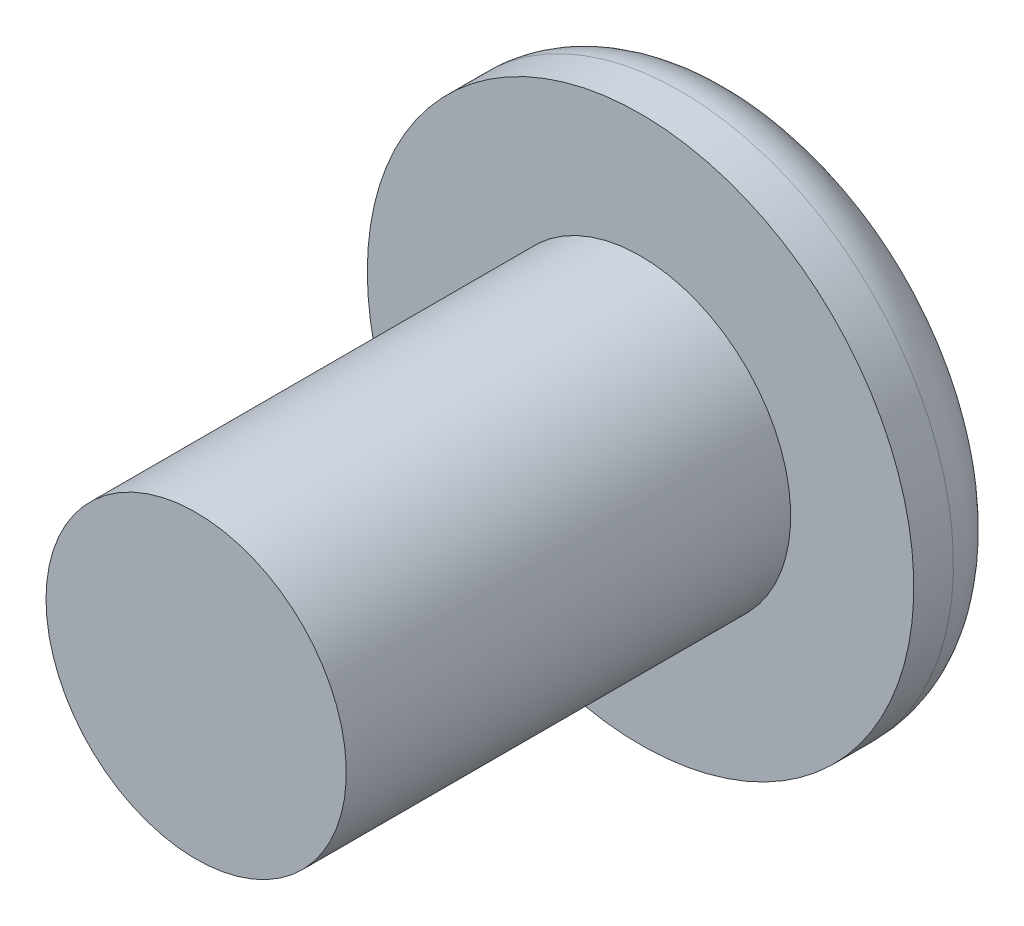
ISO-10303-21;
HEADER;
FILE_DESCRIPTION(('STEP AP214'),'2;1');
FILE_NAME('part.step','',(''),(''),'','','');
FILE_SCHEMA(('AUTOMOTIVE_DESIGN { 1 0 10303 214 1 1 1 1 }'));
ENDSEC;
DATA;
#1=APPLICATION_CONTEXT('core data for automotive mechanical design processes');
#2=APPLICATION_PROTOCOL_DEFINITION('international standard','automotive_design',2000,#1);
#3=PRODUCT_CONTEXT('',#1,'mechanical');
#4=PRODUCT('Part','Part','',(#3));
#5=PRODUCT_RELATED_PRODUCT_CATEGORY('part','',(#4));
#6=PRODUCT_DEFINITION_FORMATION('','',#4);
#7=PRODUCT_DEFINITION_CONTEXT('part definition',#1,'design');
#8=PRODUCT_DEFINITION('design','',#6,#7);
#9=PRODUCT_DEFINITION_SHAPE('','',#8);
#10=(LENGTH_UNIT() NAMED_UNIT(*) SI_UNIT(.MILLI.,.METRE.));
#11=(NAMED_UNIT(*) PLANE_ANGLE_UNIT() SI_UNIT($,.RADIAN.));
#12=(NAMED_UNIT(*) SI_UNIT($,.STERADIAN.) SOLID_ANGLE_UNIT());
#13=UNCERTAINTY_MEASURE_WITH_UNIT(LENGTH_MEASURE(1.E-05),#10,'distance_accuracy_value','');
#14=(GEOMETRIC_REPRESENTATION_CONTEXT(3) GLOBAL_UNCERTAINTY_ASSIGNED_CONTEXT((#13)) GLOBAL_UNIT_ASSIGNED_CONTEXT((#10,
#11,#12)) REPRESENTATION_CONTEXT('',''));
#15=CARTESIAN_POINT('',(0.,0.,0.));
#16=DIRECTION('',(0.,0.,1.));
#17=DIRECTION('',(1.,0.,0.));
#18=AXIS2_PLACEMENT_3D('',#15,#16,#17);
#19=CARTESIAN_POINT('',(-1.,-1.594453362781,-4.53));
#20=DIRECTION('',(-0.984807753012213,0.,0.173648177666902));
#21=DIRECTION('',(0.,1.,0.));
#22=AXIS2_PLACEMENT_3D('',#19,#20,#21);
#23=PLANE('',#22);
#24=DIRECTION('',(0.171087869746004,0.171087869746004,0.970287525247825));
#25=VECTOR('',#24,1.);
#26=CARTESIAN_POINT('',(-1.,-0.3030384493976,-4.53));
#27=LINE('',#26,#25);
#28=CARTESIAN_POINT('',(-1.,-0.3030384493976,-4.53));
#29=VERTEX_POINT('',#28);
#30=CARTESIAN_POINT('',(-0.8589384154332,-0.1619768648308,-3.73));
#31=VERTEX_POINT('',#30);
#32=EDGE_CURVE('E11',#29,#31,#27,.T.);
#33=ORIENTED_EDGE('',*,*,#32,.F.);
#34=DIRECTION('',(0.,1.,0.));
#35=VECTOR('',#34,1.);
#36=CARTESIAN_POINT('',(-1.,-0.3030384493976,-4.53));
#37=LINE('',#36,#35);
#38=CARTESIAN_POINT('',(-1.,0.3030384493976,-4.53));
#39=VERTEX_POINT('',#38);
#40=EDGE_CURVE('E409',#29,#39,#37,.T.);
#41=ORIENTED_EDGE('',*,*,#40,.T.);
#42=DIRECTION('',(0.171087869746004,-0.171087869746004,0.970287525247825));
#43=VECTOR('',#42,1.);
#44=CARTESIAN_POINT('',(-1.,0.3030384493976,-4.53));
#45=LINE('',#44,#43);
#46=CARTESIAN_POINT('',(-0.8589384154332,0.1619768648308,-3.73));
#47=VERTEX_POINT('',#46);
#48=EDGE_CURVE('E297',#39,#47,#45,.T.);
#49=ORIENTED_EDGE('',*,*,#48,.T.);
#50=DIRECTION('',(0.,1.,0.));
#51=VECTOR('',#50,1.);
#52=CARTESIAN_POINT('',(-0.8589384154332,-0.1619768648308,-3.73));
#53=LINE('',#52,#51);
#54=EDGE_CURVE('E99',#31,#47,#53,.T.);
#55=ORIENTED_EDGE('',*,*,#54,.F.);
#56=EDGE_LOOP('',(#33,#41,#49,#55));
#57=FACE_BOUND('',#56,.T.);
#58=ADVANCED_FACE('F17',(#57),#23,.F.);
#59=CARTESIAN_POINT('',(-1.838179807416,-1.338179807416,-10.435308));
#60=DIRECTION('',(0.171087869746005,0.171087869746004,0.970287525247825));
#61=DIRECTION('',(-0.984807753012214,0.,0.173648177666898));
#62=AXIS2_PLACEMENT_3D('',#59,#60,#61);
#63=CYLINDRICAL_SURFACE('',#62,0.2);
#64=CARTESIAN_POINT('',(-0.655853093055913,-0.155853093055913,-3.73));
#65=DIRECTION('',(0.,0.,-1.));
#66=DIRECTION('',(-0.707106781186547,-0.707106781186548,0.));
#67=AXIS2_PLACEMENT_3D('',#64,#65,#66);
#68=ELLIPSE('',#67,0.206124468052825,0.2);
#69=CARTESIAN_POINT('',(-0.6619768648308,-0.3589384154332,-3.73));
#70=VERTEX_POINT('',#69);
#71=EDGE_CURVE('E356',#70,#31,#68,.T.);
#72=ORIENTED_EDGE('',*,*,#71,.F.);
#73=DIRECTION('',(0.171087869746004,0.171087869746004,0.970287525247825));
#74=VECTOR('',#73,1.);
#75=CARTESIAN_POINT('',(-0.8030384493976,-0.5,-4.53));
#76=LINE('',#75,#74);
#77=CARTESIAN_POINT('',(-0.8030384493976,-0.5,-4.53));
#78=VERTEX_POINT('',#77);
#79=EDGE_CURVE('E28',#78,#70,#76,.T.);
#80=ORIENTED_EDGE('',*,*,#79,.F.);
#81=CARTESIAN_POINT('',(-0.796914677622658,-0.296914677622658,-4.53));
#82=DIRECTION('',(0.,0.,1.));
#83=DIRECTION('',(-0.707106781186547,-0.707106781186548,0.));
#84=AXIS2_PLACEMENT_3D('',#81,#82,#83);
#85=ELLIPSE('',#84,0.206124468052825,0.2);
#86=EDGE_CURVE('E405',#29,#78,#85,.T.);
#87=ORIENTED_EDGE('',*,*,#86,.F.);
#88=ORIENTED_EDGE('',*,*,#32,.T.);
#89=EDGE_LOOP('',(#72,#80,#87,#88));
#90=FACE_BOUND('',#89,.T.);
#91=ADVANCED_FACE('F561',(#90),#63,.F.);
#92=CARTESIAN_POINT('',(0.5944533627813,-0.5,-4.53));
#93=DIRECTION('',(0.,-0.984807753012213,0.173648177666902));
#94=DIRECTION('',(-1.,0.,0.));
#95=AXIS2_PLACEMENT_3D('',#92,#93,#94);
#96=PLANE('',#95);
#97=DIRECTION('',(-0.171087869746004,-0.171087869746004,-0.970287525247825));
#98=VECTOR('',#97,1.);
#99=CARTESIAN_POINT('',(-0.5558999660357,-0.3589384154332,-3.73));
#100=LINE('',#99,#98);
#101=CARTESIAN_POINT('',(-0.5558999660357,-0.3589384154332,-3.73));
#102=VERTEX_POINT('',#101);
#103=CARTESIAN_POINT('',(-0.6969615506024,-0.5,-4.53));
#104=VERTEX_POINT('',#103);
#105=EDGE_CURVE('E347',#102,#104,#100,.T.);
#106=ORIENTED_EDGE('',*,*,#105,.T.);
#107=DIRECTION('',(-1.,0.,0.));
#108=VECTOR('',#107,1.);
#109=CARTESIAN_POINT('',(-0.6969615506024,-0.5,-4.53));
#110=LINE('',#109,#108);
#111=EDGE_CURVE('E21',#104,#78,#110,.T.);
#112=ORIENTED_EDGE('',*,*,#111,.T.);
#113=ORIENTED_EDGE('',*,*,#79,.T.);
#114=DIRECTION('',(-1.,0.,0.));
#115=VECTOR('',#114,1.);
#116=CARTESIAN_POINT('',(-0.5558999660357,-0.3589384154332,-3.73));
#117=LINE('',#116,#115);
#118=EDGE_CURVE('E359',#102,#70,#117,.T.);
#119=ORIENTED_EDGE('',*,*,#118,.F.);
#120=EDGE_LOOP('',(#106,#112,#113,#119));
#121=FACE_BOUND('',#120,.T.);
#122=ADVANCED_FACE('F568',(#121),#96,.F.);
#123=CARTESIAN_POINT('',(1.136941030026,1.136941030026,5.905308));
#124=DIRECTION('',(-0.171087869746004,-0.171087869746005,-0.970287525247825));
#125=DIRECTION('',(0.,0.984807753012214,-0.173648177666898));
#126=AXIS2_PLACEMENT_3D('',#123,#124,#125);
#127=CYLINDRICAL_SURFACE('',#126,0.2);
#128=CARTESIAN_POINT('',(-0.703085322376535,-0.703085322376535,-4.53));
#129=DIRECTION('',(0.,0.,-1.));
#130=DIRECTION('',(0.707106781186548,0.707106781186547,0.));
#131=AXIS2_PLACEMENT_3D('',#128,#129,#130);
#132=ELLIPSE('',#131,0.206124468052825,0.2);
#133=CARTESIAN_POINT('',(-0.5,-0.6969615506024,-4.53));
#134=VERTEX_POINT('',#133);
#135=EDGE_CURVE('E393',#104,#134,#132,.T.);
#136=ORIENTED_EDGE('',*,*,#135,.F.);
#137=ORIENTED_EDGE('',*,*,#105,.F.);
#138=CARTESIAN_POINT('',(-0.56202373780979,-0.56202373780979,-3.73));
#139=DIRECTION('',(0.,0.,1.));
#140=DIRECTION('',(0.707106781186548,0.707106781186547,0.));
#141=AXIS2_PLACEMENT_3D('',#138,#139,#140);
#142=ELLIPSE('',#141,0.206124468052825,0.2);
#143=CARTESIAN_POINT('',(-0.3589384154332,-0.5558999660357,-3.73));
#144=VERTEX_POINT('',#143);
#145=EDGE_CURVE('E426',#144,#102,#142,.T.);
#146=ORIENTED_EDGE('',*,*,#145,.F.);
#147=DIRECTION('',(-0.171087869746004,-0.171087869746004,-0.970287525247825));
#148=VECTOR('',#147,1.);
#149=CARTESIAN_POINT('',(-0.3589384154332,-0.5558999660357,-3.73));
#150=LINE('',#149,#148);
#151=EDGE_CURVE('E390',#144,#134,#150,.T.);
#152=ORIENTED_EDGE('',*,*,#151,.T.);
#153=EDGE_LOOP('',(#136,#137,#146,#152));
#154=FACE_BOUND('',#153,.T.);
#155=ADVANCED_FACE('F573',(#154),#127,.T.);
#156=CARTESIAN_POINT('',(-0.5,-2.094453362781,-4.53));
#157=DIRECTION('',(-0.984807753012213,0.,0.173648177666902));
#158=DIRECTION('',(0.,1.,0.));
#159=AXIS2_PLACEMENT_3D('',#156,#157,#158);
#160=PLANE('',#159);
#161=ORIENTED_EDGE('',*,*,#151,.F.);
#162=DIRECTION('',(0.,1.,0.));
#163=VECTOR('',#162,1.);
#164=CARTESIAN_POINT('',(-0.3589384154332,-0.6619768648308,-3.73));
#165=LINE('',#164,#163);
#166=CARTESIAN_POINT('',(-0.3589384154332,-0.6619768648308,-3.73));
#167=VERTEX_POINT('',#166);
#168=EDGE_CURVE('E422',#167,#144,#165,.T.);
#169=ORIENTED_EDGE('',*,*,#168,.F.);
#170=DIRECTION('',(0.171087869746004,0.171087869746004,0.970287525247825));
#171=VECTOR('',#170,1.);
#172=CARTESIAN_POINT('',(-0.5,-0.8030384493976,-4.53));
#173=LINE('',#172,#171);
#174=CARTESIAN_POINT('',(-0.5,-0.8030384493976,-4.53));
#175=VERTEX_POINT('',#174);
#176=EDGE_CURVE('E387',#175,#167,#173,.T.);
#177=ORIENTED_EDGE('',*,*,#176,.F.);
#178=DIRECTION('',(0.,1.,0.));
#179=VECTOR('',#178,1.);
#180=CARTESIAN_POINT('',(-0.5,-0.8030384493976,-4.53));
#181=LINE('',#180,#179);
#182=EDGE_CURVE('E397',#175,#134,#181,.T.);
#183=ORIENTED_EDGE('',*,*,#182,.T.);
#184=EDGE_LOOP('',(#161,#169,#177,#183));
#185=FACE_BOUND('',#184,.T.);
#186=ADVANCED_FACE('F928',(#185),#160,.F.);
#187=CARTESIAN_POINT('',(-1.338179807416,-1.838179807416,-10.435308));
#188=DIRECTION('',(0.171087869746005,0.171087869746004,0.970287525247825));
#189=DIRECTION('',(-0.984807753012214,0.,0.173648177666898));
#190=AXIS2_PLACEMENT_3D('',#187,#188,#189);
#191=CYLINDRICAL_SURFACE('',#190,0.2);
#192=CARTESIAN_POINT('',(-0.155853093055913,-0.655853093055913,-3.73));
#193=DIRECTION('',(0.,0.,-1.));
#194=DIRECTION('',(-0.707106781186547,-0.707106781186548,0.));
#195=AXIS2_PLACEMENT_3D('',#192,#193,#194);
#196=ELLIPSE('',#195,0.206124468052825,0.2);
#197=CARTESIAN_POINT('',(-0.1619768648308,-0.8589384154332,-3.73));
#198=VERTEX_POINT('',#197);
#199=EDGE_CURVE('E427',#198,#167,#196,.T.);
#200=ORIENTED_EDGE('',*,*,#199,.F.);
#201=DIRECTION('',(0.171087869746004,0.171087869746004,0.970287525247825));
#202=VECTOR('',#201,1.);
#203=CARTESIAN_POINT('',(-0.3030384493976,-1.,-4.53));
#204=LINE('',#203,#202);
#205=CARTESIAN_POINT('',(-0.3030384493976,-1.,-4.53));
#206=VERTEX_POINT('',#205);
#207=EDGE_CURVE('E290',#206,#198,#204,.T.);
#208=ORIENTED_EDGE('',*,*,#207,.F.);
#209=CARTESIAN_POINT('',(-0.296914677622658,-0.796914677622658,-4.53));
#210=DIRECTION('',(0.,0.,1.));
#211=DIRECTION('',(-0.707106781186547,-0.707106781186548,0.));
#212=AXIS2_PLACEMENT_3D('',#209,#210,#211);
#213=ELLIPSE('',#212,0.206124468052825,0.2);
#214=EDGE_CURVE('E401',#175,#206,#213,.T.);
#215=ORIENTED_EDGE('',*,*,#214,.F.);
#216=ORIENTED_EDGE('',*,*,#176,.T.);
#217=EDGE_LOOP('',(#200,#208,#215,#216));
#218=FACE_BOUND('',#217,.T.);
#219=ADVANCED_FACE('F923',(#218),#191,.F.);
#220=CARTESIAN_POINT('',(1.594453362781,-1.,-4.53));
#221=DIRECTION('',(0.,-0.984807753012213,0.173648177666902));
#222=DIRECTION('',(-1.,0.,0.));
#223=AXIS2_PLACEMENT_3D('',#220,#221,#222);
#224=PLANE('',#223);
#225=DIRECTION('',(-0.171087869746004,0.171087869746004,0.970287525247825));
#226=VECTOR('',#225,1.);
#227=CARTESIAN_POINT('',(0.3030384493976,-1.,-4.53));
#228=LINE('',#227,#226);
#229=CARTESIAN_POINT('',(0.3030384493976,-1.,-4.53));
#230=VERTEX_POINT('',#229);
#231=CARTESIAN_POINT('',(0.1619768648308,-0.8589384154332,-3.73));
#232=VERTEX_POINT('',#231);
#233=EDGE_CURVE('E437',#230,#232,#228,.T.);
#234=ORIENTED_EDGE('',*,*,#233,.F.);
#235=DIRECTION('',(-1.,0.,0.));
#236=VECTOR('',#235,1.);
#237=CARTESIAN_POINT('',(0.3030384493976,-1.,-4.53));
#238=LINE('',#237,#236);
#239=EDGE_CURVE('E318',#230,#206,#238,.T.);
#240=ORIENTED_EDGE('',*,*,#239,.T.);
#241=ORIENTED_EDGE('',*,*,#207,.T.);
#242=DIRECTION('',(-1.,0.,0.));
#243=VECTOR('',#242,1.);
#244=CARTESIAN_POINT('',(0.1619768648308,-0.8589384154332,-3.73));
#245=LINE('',#244,#243);
#246=EDGE_CURVE('E342',#232,#198,#245,.T.);
#247=ORIENTED_EDGE('',*,*,#246,.F.);
#248=EDGE_LOOP('',(#234,#240,#241,#247));
#249=FACE_BOUND('',#248,.T.);
#250=ADVANCED_FACE('F595',(#249),#224,.F.);
#251=CARTESIAN_POINT('',(1.338179807416,-1.838179807416,-10.435308));
#252=DIRECTION('',(-0.171087869746004,0.171087869746005,0.970287525247825));
#253=DIRECTION('',(0.,-0.984807753012214,0.173648177666898));
#254=AXIS2_PLACEMENT_3D('',#251,#252,#253);
#255=CYLINDRICAL_SURFACE('',#254,0.2);
#256=CARTESIAN_POINT('',(0.155853093055913,-0.655853093055913,-3.73));
#257=DIRECTION('',(0.,0.,-1.));
#258=DIRECTION('',(0.707106781186548,-0.707106781186547,0.));
#259=AXIS2_PLACEMENT_3D('',#256,#257,#258);
#260=ELLIPSE('',#259,0.206124468052825,0.2);
#261=CARTESIAN_POINT('',(0.3589384154332,-0.6619768648308,-3.73));
#262=VERTEX_POINT('',#261);
#263=EDGE_CURVE('E338',#262,#232,#260,.T.);
#264=ORIENTED_EDGE('',*,*,#263,.F.);
#265=DIRECTION('',(-0.171087869746004,0.171087869746004,0.970287525247825));
#266=VECTOR('',#265,1.);
#267=CARTESIAN_POINT('',(0.5,-0.8030384493976,-4.53));
#268=LINE('',#267,#266);
#269=CARTESIAN_POINT('',(0.5,-0.8030384493976,-4.53));
#270=VERTEX_POINT('',#269);
#271=EDGE_CURVE('E421',#270,#262,#268,.T.);
#272=ORIENTED_EDGE('',*,*,#271,.F.);
#273=CARTESIAN_POINT('',(0.296914677622658,-0.796914677622658,-4.53));
#274=DIRECTION('',(0.,0.,1.));
#275=DIRECTION('',(0.707106781186548,-0.707106781186547,0.));
#276=AXIS2_PLACEMENT_3D('',#273,#274,#275);
#277=ELLIPSE('',#276,0.206124468052825,0.2);
#278=EDGE_CURVE('E313',#230,#270,#277,.T.);
#279=ORIENTED_EDGE('',*,*,#278,.F.);
#280=ORIENTED_EDGE('',*,*,#233,.T.);
#281=EDGE_LOOP('',(#264,#272,#279,#280));
#282=FACE_BOUND('',#281,.T.);
#283=ADVANCED_FACE('F592',(#282),#255,.F.);
#284=CARTESIAN_POINT('',(0.5,0.5944533627813,-4.53));
#285=DIRECTION('',(0.984807753012213,0.,0.173648177666902));
#286=DIRECTION('',(0.,-1.,0.));
#287=AXIS2_PLACEMENT_3D('',#284,#285,#286);
#288=PLANE('',#287);
#289=DIRECTION('',(0.171087869746004,-0.171087869746004,-0.970287525247825));
#290=VECTOR('',#289,1.);
#291=CARTESIAN_POINT('',(0.3589384154332,-0.5558999660357,-3.73));
#292=LINE('',#291,#290);
#293=CARTESIAN_POINT('',(0.3589384154332,-0.5558999660357,-3.73));
#294=VERTEX_POINT('',#293);
#295=CARTESIAN_POINT('',(0.5,-0.6969615506024,-4.53));
#296=VERTEX_POINT('',#295);
#297=EDGE_CURVE('E336',#294,#296,#292,.T.);
#298=ORIENTED_EDGE('',*,*,#297,.T.);
#299=DIRECTION('',(0.,-1.,0.));
#300=VECTOR('',#299,1.);
#301=CARTESIAN_POINT('',(0.5,-0.6969615506024,-4.53));
#302=LINE('',#301,#300);
#303=EDGE_CURVE('E317',#296,#270,#302,.T.);
#304=ORIENTED_EDGE('',*,*,#303,.T.);
#305=ORIENTED_EDGE('',*,*,#271,.T.);
#306=DIRECTION('',(0.,-1.,0.));
#307=VECTOR('',#306,1.);
#308=CARTESIAN_POINT('',(0.3589384154332,-0.5558999660357,-3.73));
#309=LINE('',#308,#307);
#310=EDGE_CURVE('E343',#294,#262,#309,.T.);
#311=ORIENTED_EDGE('',*,*,#310,.F.);
#312=EDGE_LOOP('',(#298,#304,#305,#311));
#313=FACE_BOUND('',#312,.T.);
#314=ADVANCED_FACE('F594',(#313),#288,.F.);
#315=CARTESIAN_POINT('',(-1.136941030026,1.136941030026,5.905308));
#316=DIRECTION('',(0.171087869746005,-0.171087869746004,-0.970287525247825));
#317=DIRECTION('',(-0.984807753012214,0.,-0.173648177666898));
#318=AXIS2_PLACEMENT_3D('',#315,#316,#317);
#319=CYLINDRICAL_SURFACE('',#318,0.2);
#320=CARTESIAN_POINT('',(0.703085322376535,-0.703085322376535,-4.53));
#321=DIRECTION('',(0.,0.,-1.));
#322=DIRECTION('',(-0.707106781186547,0.707106781186548,0.));
#323=AXIS2_PLACEMENT_3D('',#320,#321,#322);
#324=ELLIPSE('',#323,0.206124468052825,0.2);
#325=CARTESIAN_POINT('',(0.6969615506024,-0.5,-4.53));
#326=VERTEX_POINT('',#325);
#327=EDGE_CURVE('E455',#296,#326,#324,.T.);
#328=ORIENTED_EDGE('',*,*,#327,.F.);
#329=ORIENTED_EDGE('',*,*,#297,.F.);
#330=CARTESIAN_POINT('',(0.56202373780979,-0.56202373780979,-3.73));
#331=DIRECTION('',(0.,0.,1.));
#332=DIRECTION('',(-0.707106781186547,0.707106781186548,0.));
#333=AXIS2_PLACEMENT_3D('',#330,#331,#332);
#334=ELLIPSE('',#333,0.206124468052825,0.2);
#335=CARTESIAN_POINT('',(0.5558999660357,-0.3589384154332,-3.73));
#336=VERTEX_POINT('',#335);
#337=EDGE_CURVE('E371',#336,#294,#334,.T.);
#338=ORIENTED_EDGE('',*,*,#337,.F.);
#339=DIRECTION('',(0.171087869746004,-0.171087869746004,-0.970287525247825));
#340=VECTOR('',#339,1.);
#341=CARTESIAN_POINT('',(0.5558999660357,-0.3589384154332,-3.73));
#342=LINE('',#341,#340);
#343=EDGE_CURVE('E332',#336,#326,#342,.T.);
#344=ORIENTED_EDGE('',*,*,#343,.T.);
#345=EDGE_LOOP('',(#328,#329,#338,#344));
#346=FACE_BOUND('',#345,.T.);
#347=ADVANCED_FACE('F583',(#346),#319,.T.);
#348=CARTESIAN_POINT('',(2.094453362781,-0.5,-4.53));
#349=DIRECTION('',(0.,-0.984807753012213,0.173648177666902));
#350=DIRECTION('',(-1.,0.,0.));
#351=AXIS2_PLACEMENT_3D('',#348,#349,#350);
#352=PLANE('',#351);
#353=ORIENTED_EDGE('',*,*,#343,.F.);
#354=DIRECTION('',(-1.,0.,0.));
#355=VECTOR('',#354,1.);
#356=CARTESIAN_POINT('',(0.6619768648308,-0.3589384154332,-3.73));
#357=LINE('',#356,#355);
#358=CARTESIAN_POINT('',(0.6619768648308,-0.3589384154332,-3.73));
#359=VERTEX_POINT('',#358);
#360=EDGE_CURVE('E352',#359,#336,#357,.T.);
#361=ORIENTED_EDGE('',*,*,#360,.F.);
#362=DIRECTION('',(-0.171087869746004,0.171087869746004,0.970287525247825));
#363=VECTOR('',#362,1.);
#364=CARTESIAN_POINT('',(0.8030384493976,-0.5,-4.53));
#365=LINE('',#364,#363);
#366=CARTESIAN_POINT('',(0.8030384493976,-0.5,-4.53));
#367=VERTEX_POINT('',#366);
#368=EDGE_CURVE('E337',#367,#359,#365,.T.);
#369=ORIENTED_EDGE('',*,*,#368,.F.);
#370=DIRECTION('',(-1.,0.,0.));
#371=VECTOR('',#370,1.);
#372=CARTESIAN_POINT('',(0.8030384493976,-0.5,-4.53));
#373=LINE('',#372,#371);
#374=EDGE_CURVE('E286',#367,#326,#373,.T.);
#375=ORIENTED_EDGE('',*,*,#374,.T.);
#376=EDGE_LOOP('',(#353,#361,#369,#375));
#377=FACE_BOUND('',#376,.T.);
#378=ADVANCED_FACE('F579',(#377),#352,.F.);
#379=CARTESIAN_POINT('',(1.838179807416,-1.338179807416,-10.435308));
#380=DIRECTION('',(-0.171087869746004,0.171087869746005,0.970287525247825));
#381=DIRECTION('',(0.,-0.984807753012214,0.173648177666898));
#382=AXIS2_PLACEMENT_3D('',#379,#380,#381);
#383=CYLINDRICAL_SURFACE('',#382,0.2);
#384=CARTESIAN_POINT('',(0.655853093055913,-0.155853093055913,-3.73));
#385=DIRECTION('',(0.,0.,-1.));
#386=DIRECTION('',(0.707106781186548,-0.707106781186547,0.));
#387=AXIS2_PLACEMENT_3D('',#384,#385,#386);
#388=ELLIPSE('',#387,0.206124468052825,0.2);
#389=CARTESIAN_POINT('',(0.8589384154332,-0.1619768648308,-3.73));
#390=VERTEX_POINT('',#389);
#391=EDGE_CURVE('E348',#390,#359,#388,.T.);
#392=ORIENTED_EDGE('',*,*,#391,.F.);
#393=DIRECTION('',(-0.171087869746004,0.171087869746004,0.970287525247825));
#394=VECTOR('',#393,1.);
#395=CARTESIAN_POINT('',(1.,-0.3030384493976,-4.53));
#396=LINE('',#395,#394);
#397=CARTESIAN_POINT('',(1.,-0.3030384493976,-4.53));
#398=VERTEX_POINT('',#397);
#399=EDGE_CURVE('E193',#398,#390,#396,.T.);
#400=ORIENTED_EDGE('',*,*,#399,.F.);
#401=CARTESIAN_POINT('',(0.796914677622658,-0.296914677622658,-4.53));
#402=DIRECTION('',(0.,0.,1.));
#403=DIRECTION('',(0.707106781186548,-0.707106781186547,0.));
#404=AXIS2_PLACEMENT_3D('',#401,#402,#403);
#405=ELLIPSE('',#404,0.206124468052825,0.2);
#406=EDGE_CURVE('E279',#367,#398,#405,.T.);
#407=ORIENTED_EDGE('',*,*,#406,.F.);
#408=ORIENTED_EDGE('',*,*,#368,.T.);
#409=EDGE_LOOP('',(#392,#400,#407,#408));
#410=FACE_BOUND('',#409,.T.);
#411=ADVANCED_FACE('F582',(#410),#383,.F.);
#412=CARTESIAN_POINT('',(1.,1.594453362781,-4.53));
#413=DIRECTION('',(0.984807753012213,0.,0.173648177666902));
#414=DIRECTION('',(0.,-1.,0.));
#415=AXIS2_PLACEMENT_3D('',#412,#413,#414);
#416=PLANE('',#415);
#417=DIRECTION('',(-0.171087869746004,-0.171087869746004,0.970287525247825));
#418=VECTOR('',#417,1.);
#419=CARTESIAN_POINT('',(1.,0.3030384493976,-4.53));
#420=LINE('',#419,#418);
#421=CARTESIAN_POINT('',(1.,0.3030384493976,-4.53));
#422=VERTEX_POINT('',#421);
#423=CARTESIAN_POINT('',(0.8589384154332,0.1619768648308,-3.73));
#424=VERTEX_POINT('',#423);
#425=EDGE_CURVE('E182',#422,#424,#420,.T.);
#426=ORIENTED_EDGE('',*,*,#425,.F.);
#427=DIRECTION('',(0.,-1.,0.));
#428=VECTOR('',#427,1.);
#429=CARTESIAN_POINT('',(1.,0.3030384493976,-4.53));
#430=LINE('',#429,#428);
#431=EDGE_CURVE('E258',#422,#398,#430,.T.);
#432=ORIENTED_EDGE('',*,*,#431,.T.);
#433=ORIENTED_EDGE('',*,*,#399,.T.);
#434=DIRECTION('',(0.,-1.,0.));
#435=VECTOR('',#434,1.);
#436=CARTESIAN_POINT('',(0.8589384154332,0.1619768648308,-3.73));
#437=LINE('',#436,#435);
#438=EDGE_CURVE('E261',#424,#390,#437,.T.);
#439=ORIENTED_EDGE('',*,*,#438,.F.);
#440=EDGE_LOOP('',(#426,#432,#433,#439));
#441=FACE_BOUND('',#440,.T.);
#442=ADVANCED_FACE('F256',(#441),#416,.F.);
#443=CARTESIAN_POINT('',(1.838179807416,1.338179807416,-10.435308));
#444=DIRECTION('',(-0.171087869746005,-0.171087869746004,0.970287525247825));
#445=DIRECTION('',(0.984807753012214,0.,0.173648177666898));
#446=AXIS2_PLACEMENT_3D('',#443,#444,#445);
#447=CYLINDRICAL_SURFACE('',#446,0.2);
#448=CARTESIAN_POINT('',(0.655853093055913,0.155853093055913,-3.73));
#449=DIRECTION('',(0.,0.,-1.));
#450=DIRECTION('',(0.707106781186547,0.707106781186548,0.));
#451=AXIS2_PLACEMENT_3D('',#448,#449,#450);
#452=ELLIPSE('',#451,0.206124468052825,0.2);
#453=CARTESIAN_POINT('',(0.6619768648308,0.3589384154332,-3.73));
#454=VERTEX_POINT('',#453);
#455=EDGE_CURVE('E330',#454,#424,#452,.T.);
#456=ORIENTED_EDGE('',*,*,#455,.F.);
#457=DIRECTION('',(-0.171087869746004,-0.171087869746004,0.970287525247825));
#458=VECTOR('',#457,1.);
#459=CARTESIAN_POINT('',(0.8030384493976,0.5,-4.53));
#460=LINE('',#459,#458);
#461=CARTESIAN_POINT('',(0.8030384493976,0.5,-4.53));
#462=VERTEX_POINT('',#461);
#463=EDGE_CURVE('E253',#462,#454,#460,.T.);
#464=ORIENTED_EDGE('',*,*,#463,.F.);
#465=CARTESIAN_POINT('',(0.796914677622658,0.296914677622658,-4.53));
#466=DIRECTION('',(0.,0.,1.));
#467=DIRECTION('',(0.707106781186547,0.707106781186548,0.));
#468=AXIS2_PLACEMENT_3D('',#465,#466,#467);
#469=ELLIPSE('',#468,0.206124468052825,0.2);
#470=EDGE_CURVE('E267',#422,#462,#469,.T.);
#471=ORIENTED_EDGE('',*,*,#470,.F.);
#472=ORIENTED_EDGE('',*,*,#425,.T.);
#473=EDGE_LOOP('',(#456,#464,#471,#472));
#474=FACE_BOUND('',#473,.T.);
#475=ADVANCED_FACE('F268',(#474),#447,.F.);
#476=CARTESIAN_POINT('',(-0.5,-0.5944533627813,-4.53));
#477=DIRECTION('',(-0.984807753012213,0.,0.173648177666902));
#478=DIRECTION('',(0.,1.,0.));
#479=AXIS2_PLACEMENT_3D('',#476,#477,#478);
#480=PLANE('',#479);
#481=DIRECTION('',(-0.171087869746004,0.171087869746004,-0.970287525247825));
#482=VECTOR('',#481,1.);
#483=CARTESIAN_POINT('',(-0.3589384154332,0.5558999660357,-3.73));
#484=LINE('',#483,#482);
#485=CARTESIAN_POINT('',(-0.3589384154332,0.5558999660357,-3.73));
#486=VERTEX_POINT('',#485);
#487=CARTESIAN_POINT('',(-0.5,0.6969615506024,-4.53));
#488=VERTEX_POINT('',#487);
#489=EDGE_CURVE('E152',#486,#488,#484,.T.);
#490=ORIENTED_EDGE('',*,*,#489,.T.);
#491=DIRECTION('',(0.,1.,0.));
#492=VECTOR('',#491,1.);
#493=CARTESIAN_POINT('',(-0.5,0.6969615506024,-4.53));
#494=LINE('',#493,#492);
#495=CARTESIAN_POINT('',(-0.5,0.8030384493976,-4.53));
#496=VERTEX_POINT('',#495);
#497=EDGE_CURVE('E367',#488,#496,#494,.T.);
#498=ORIENTED_EDGE('',*,*,#497,.T.);
#499=DIRECTION('',(0.171087869746004,-0.171087869746004,0.970287525247825));
#500=VECTOR('',#499,1.);
#501=CARTESIAN_POINT('',(-0.5,0.8030384493976,-4.53));
#502=LINE('',#501,#500);
#503=CARTESIAN_POINT('',(-0.3589384154332,0.6619768648308,-3.73));
#504=VERTEX_POINT('',#503);
#505=EDGE_CURVE('E264',#496,#504,#502,.T.);
#506=ORIENTED_EDGE('',*,*,#505,.T.);
#507=DIRECTION('',(0.,1.,0.));
#508=VECTOR('',#507,1.);
#509=CARTESIAN_POINT('',(-0.3589384154332,0.5558999660357,-3.73));
#510=LINE('',#509,#508);
#511=EDGE_CURVE('E462',#486,#504,#510,.T.);
#512=ORIENTED_EDGE('',*,*,#511,.F.);
#513=EDGE_LOOP('',(#490,#498,#506,#512));
#514=FACE_BOUND('',#513,.T.);
#515=ADVANCED_FACE('F603',(#514),#480,.F.);
#516=CARTESIAN_POINT('',(-1.338179807416,1.838179807416,-10.435308));
#517=DIRECTION('',(0.171087869746004,-0.171087869746005,0.970287525247825));
#518=DIRECTION('',(0.,0.984807753012214,0.173648177666898));
#519=AXIS2_PLACEMENT_3D('',#516,#517,#518);
#520=CYLINDRICAL_SURFACE('',#519,0.2);
#521=CARTESIAN_POINT('',(-0.155853093055913,0.655853093055913,-3.73));
#522=DIRECTION('',(0.,0.,-1.));
#523=DIRECTION('',(-0.707106781186548,0.707106781186547,0.));
#524=AXIS2_PLACEMENT_3D('',#521,#522,#523);
#525=ELLIPSE('',#524,0.206124468052825,0.2);
#526=CARTESIAN_POINT('',(-0.1619768648308,0.8589384154332,-3.73));
#527=VERTEX_POINT('',#526);
#528=EDGE_CURVE('E466',#504,#527,#525,.T.);
#529=ORIENTED_EDGE('',*,*,#528,.F.);
#530=ORIENTED_EDGE('',*,*,#505,.F.);
#531=CARTESIAN_POINT('',(-0.296914677622658,0.796914677622658,-4.53));
#532=DIRECTION('',(0.,0.,1.));
#533=DIRECTION('',(-0.707106781186548,0.707106781186547,0.));
#534=AXIS2_PLACEMENT_3D('',#531,#532,#533);
#535=ELLIPSE('',#534,0.206124468052825,0.2);
#536=CARTESIAN_POINT('',(-0.3030384493976,1.,-4.53));
#537=VERTEX_POINT('',#536);
#538=EDGE_CURVE('E370',#537,#496,#535,.T.);
#539=ORIENTED_EDGE('',*,*,#538,.F.);
#540=DIRECTION('',(0.171087869746004,-0.171087869746004,0.970287525247825));
#541=VECTOR('',#540,1.);
#542=CARTESIAN_POINT('',(-0.3030384493976,1.,-4.53));
#543=LINE('',#542,#541);
#544=EDGE_CURVE('E304',#537,#527,#543,.T.);
#545=ORIENTED_EDGE('',*,*,#544,.T.);
#546=EDGE_LOOP('',(#529,#530,#539,#545));
#547=FACE_BOUND('',#546,.T.);
#548=ADVANCED_FACE('F532',(#547),#520,.F.);
#549=CARTESIAN_POINT('',(-1.594453362781,1.,-4.53));
#550=DIRECTION('',(0.,0.984807753012213,0.173648177666902));
#551=DIRECTION('',(1.,0.,0.));
#552=AXIS2_PLACEMENT_3D('',#549,#550,#551);
#553=PLANE('',#552);
#554=ORIENTED_EDGE('',*,*,#544,.F.);
#555=DIRECTION('',(1.,0.,0.));
#556=VECTOR('',#555,1.);
#557=CARTESIAN_POINT('',(-0.3030384493976,1.,-4.53));
#558=LINE('',#557,#556);
#559=CARTESIAN_POINT('',(0.3030384493976,1.,-4.53));
#560=VERTEX_POINT('',#559);
#561=EDGE_CURVE('E323',#537,#560,#558,.T.);
#562=ORIENTED_EDGE('',*,*,#561,.T.);
#563=DIRECTION('',(-0.171087869746004,-0.171087869746004,0.970287525247825));
#564=VECTOR('',#563,1.);
#565=CARTESIAN_POINT('',(0.3030384493976,1.,-4.53));
#566=LINE('',#565,#564);
#567=CARTESIAN_POINT('',(0.1619768648308,0.8589384154332,-3.73));
#568=VERTEX_POINT('',#567);
#569=EDGE_CURVE('E327',#560,#568,#566,.T.);
#570=ORIENTED_EDGE('',*,*,#569,.T.);
#571=DIRECTION('',(1.,0.,0.));
#572=VECTOR('',#571,1.);
#573=CARTESIAN_POINT('',(-0.1619768648308,0.8589384154332,-3.73));
#574=LINE('',#573,#572);
#575=EDGE_CURVE('E472',#527,#568,#574,.T.);
#576=ORIENTED_EDGE('',*,*,#575,.F.);
#577=EDGE_LOOP('',(#554,#562,#570,#576));
#578=FACE_BOUND('',#577,.T.);
#579=ADVANCED_FACE('F537',(#578),#553,.F.);
#580=CARTESIAN_POINT('',(1.338179807416,1.838179807416,-10.435308));
#581=DIRECTION('',(-0.171087869746005,-0.171087869746004,0.970287525247825));
#582=DIRECTION('',(0.984807753012214,0.,0.173648177666898));
#583=AXIS2_PLACEMENT_3D('',#580,#581,#582);
#584=CYLINDRICAL_SURFACE('',#583,0.2);
#585=CARTESIAN_POINT('',(0.155853093055913,0.655853093055913,-3.73));
#586=DIRECTION('',(0.,0.,-1.));
#587=DIRECTION('',(0.707106781186547,0.707106781186548,0.));
#588=AXIS2_PLACEMENT_3D('',#585,#586,#587);
#589=ELLIPSE('',#588,0.206124468052825,0.2);
#590=CARTESIAN_POINT('',(0.3589384154332,0.6619768648308,-3.73));
#591=VERTEX_POINT('',#590);
#592=EDGE_CURVE('E467',#568,#591,#589,.T.);
#593=ORIENTED_EDGE('',*,*,#592,.F.);
#594=ORIENTED_EDGE('',*,*,#569,.F.);
#595=CARTESIAN_POINT('',(0.296914677622658,0.796914677622658,-4.53));
#596=DIRECTION('',(0.,0.,1.));
#597=DIRECTION('',(0.707106781186547,0.707106781186548,0.));
#598=AXIS2_PLACEMENT_3D('',#595,#596,#597);
#599=ELLIPSE('',#598,0.206124468052825,0.2);
#600=CARTESIAN_POINT('',(0.5,0.8030384493976,-4.53));
#601=VERTEX_POINT('',#600);
#602=EDGE_CURVE('E319',#601,#560,#599,.T.);
#603=ORIENTED_EDGE('',*,*,#602,.F.);
#604=DIRECTION('',(-0.171087869746004,-0.171087869746004,0.970287525247825));
#605=VECTOR('',#604,1.);
#606=CARTESIAN_POINT('',(0.5,0.8030384493976,-4.53));
#607=LINE('',#606,#605);
#608=EDGE_CURVE('E355',#601,#591,#607,.T.);
#609=ORIENTED_EDGE('',*,*,#608,.T.);
#610=EDGE_LOOP('',(#593,#594,#603,#609));
#611=FACE_BOUND('',#610,.T.);
#612=ADVANCED_FACE('F541',(#611),#584,.F.);
#613=CARTESIAN_POINT('',(0.5,2.094453362781,-4.53));
#614=DIRECTION('',(0.984807753012213,0.,0.173648177666902));
#615=DIRECTION('',(0.,-1.,0.));
#616=AXIS2_PLACEMENT_3D('',#613,#614,#615);
#617=PLANE('',#616);
#618=DIRECTION('',(0.171087869746004,0.171087869746004,-0.970287525247825));
#619=VECTOR('',#618,1.);
#620=CARTESIAN_POINT('',(0.3589384154332,0.5558999660357,-3.73));
#621=LINE('',#620,#619);
#622=CARTESIAN_POINT('',(0.3589384154332,0.5558999660357,-3.73));
#623=VERTEX_POINT('',#622);
#624=CARTESIAN_POINT('',(0.5,0.6969615506024,-4.53));
#625=VERTEX_POINT('',#624);
#626=EDGE_CURVE('E42',#623,#625,#621,.T.);
#627=ORIENTED_EDGE('',*,*,#626,.F.);
#628=DIRECTION('',(0.,-1.,0.));
#629=VECTOR('',#628,1.);
#630=CARTESIAN_POINT('',(0.3589384154332,0.6619768648308,-3.73));
#631=LINE('',#630,#629);
#632=EDGE_CURVE('E471',#591,#623,#631,.T.);
#633=ORIENTED_EDGE('',*,*,#632,.F.);
#634=ORIENTED_EDGE('',*,*,#608,.F.);
#635=DIRECTION('',(0.,-1.,0.));
#636=VECTOR('',#635,1.);
#637=CARTESIAN_POINT('',(0.5,0.8030384493976,-4.53));
#638=LINE('',#637,#636);
#639=EDGE_CURVE('E324',#601,#625,#638,.T.);
#640=ORIENTED_EDGE('',*,*,#639,.T.);
#641=EDGE_LOOP('',(#627,#633,#634,#640));
#642=FACE_BOUND('',#641,.T.);
#643=ADVANCED_FACE('F543',(#642),#617,.F.);
#644=CARTESIAN_POINT('',(-1.136941030026,-1.136941030026,5.905308));
#645=DIRECTION('',(0.171087869746004,0.171087869746005,-0.970287525247825));
#646=DIRECTION('',(0.,-0.984807753012214,-0.173648177666898));
#647=AXIS2_PLACEMENT_3D('',#644,#645,#646);
#648=CYLINDRICAL_SURFACE('',#647,0.2);
#649=CARTESIAN_POINT('',(0.703085322376535,0.703085322376535,-4.53));
#650=DIRECTION('',(0.,0.,-1.));
#651=DIRECTION('',(-0.707106781186548,-0.707106781186547,0.));
#652=AXIS2_PLACEMENT_3D('',#649,#650,#651);
#653=ELLIPSE('',#652,0.206124468052825,0.2);
#654=CARTESIAN_POINT('',(0.6969615506024,0.5,-4.53));
#655=VERTEX_POINT('',#654);
#656=EDGE_CURVE('E366',#655,#625,#653,.T.);
#657=ORIENTED_EDGE('',*,*,#656,.F.);
#658=DIRECTION('',(0.171087869746004,0.171087869746004,-0.970287525247825));
#659=VECTOR('',#658,1.);
#660=CARTESIAN_POINT('',(0.5558999660357,0.3589384154332,-3.73));
#661=LINE('',#660,#659);
#662=CARTESIAN_POINT('',(0.5558999660357,0.3589384154332,-3.73));
#663=VERTEX_POINT('',#662);
#664=EDGE_CURVE('E83',#663,#655,#661,.T.);
#665=ORIENTED_EDGE('',*,*,#664,.F.);
#666=CARTESIAN_POINT('',(0.56202373780979,0.56202373780979,-3.73));
#667=DIRECTION('',(0.,0.,1.));
#668=DIRECTION('',(-0.707106781186548,-0.707106781186547,0.));
#669=AXIS2_PLACEMENT_3D('',#666,#667,#668);
#670=ELLIPSE('',#669,0.206124468052825,0.2);
#671=EDGE_CURVE('E312',#623,#663,#670,.T.);
#672=ORIENTED_EDGE('',*,*,#671,.F.);
#673=ORIENTED_EDGE('',*,*,#626,.T.);
#674=EDGE_LOOP('',(#657,#665,#672,#673));
#675=FACE_BOUND('',#674,.T.);
#676=ADVANCED_FACE('F545',(#675),#648,.T.);
#677=CARTESIAN_POINT('',(-0.5944533627813,0.5,-4.53));
#678=DIRECTION('',(0.,0.984807753012213,0.173648177666902));
#679=DIRECTION('',(1.,0.,0.));
#680=AXIS2_PLACEMENT_3D('',#677,#678,#679);
#681=PLANE('',#680);
#682=ORIENTED_EDGE('',*,*,#664,.T.);
#683=DIRECTION('',(1.,0.,0.));
#684=VECTOR('',#683,1.);
#685=CARTESIAN_POINT('',(0.6969615506024,0.5,-4.53));
#686=LINE('',#685,#684);
#687=EDGE_CURVE('E272',#655,#462,#686,.T.);
#688=ORIENTED_EDGE('',*,*,#687,.T.);
#689=ORIENTED_EDGE('',*,*,#463,.T.);
#690=DIRECTION('',(1.,0.,0.));
#691=VECTOR('',#690,1.);
#692=CARTESIAN_POINT('',(0.5558999660357,0.3589384154332,-3.73));
#693=LINE('',#692,#691);
#694=EDGE_CURVE('E300',#663,#454,#693,.T.);
#695=ORIENTED_EDGE('',*,*,#694,.F.);
#696=EDGE_LOOP('',(#682,#688,#689,#695));
#697=FACE_BOUND('',#696,.T.);
#698=ADVANCED_FACE('F547',(#697),#681,.F.);
#699=CARTESIAN_POINT('',(0.,0.,-3.73));
#700=DIRECTION('',(0.,0.,-1.));
#701=DIRECTION('',(0.,-1.,0.));
#702=AXIS2_PLACEMENT_3D('',#699,#700,#701);
#703=PLANE('',#702);
#704=ORIENTED_EDGE('',*,*,#694,.T.);
#705=ORIENTED_EDGE('',*,*,#455,.T.);
#706=ORIENTED_EDGE('',*,*,#438,.T.);
#707=ORIENTED_EDGE('',*,*,#391,.T.);
#708=ORIENTED_EDGE('',*,*,#360,.T.);
#709=ORIENTED_EDGE('',*,*,#337,.T.);
#710=ORIENTED_EDGE('',*,*,#310,.T.);
#711=ORIENTED_EDGE('',*,*,#263,.T.);
#712=ORIENTED_EDGE('',*,*,#246,.T.);
#713=ORIENTED_EDGE('',*,*,#199,.T.);
#714=ORIENTED_EDGE('',*,*,#168,.T.);
#715=ORIENTED_EDGE('',*,*,#145,.T.);
#716=ORIENTED_EDGE('',*,*,#118,.T.);
#717=ORIENTED_EDGE('',*,*,#71,.T.);
#718=ORIENTED_EDGE('',*,*,#54,.T.);
#719=CARTESIAN_POINT('',(-0.655853093055913,0.155853093055913,-3.73));
#720=DIRECTION('',(0.,0.,-1.));
#721=DIRECTION('',(-0.707106781186548,0.707106781186547,0.));
#722=AXIS2_PLACEMENT_3D('',#719,#720,#721);
#723=ELLIPSE('',#722,0.206124468052825,0.2);
#724=CARTESIAN_POINT('',(-0.6619768648308,0.3589384154332,-3.73));
#725=VERTEX_POINT('',#724);
#726=EDGE_CURVE('E301',#47,#725,#723,.T.);
#727=ORIENTED_EDGE('',*,*,#726,.T.);
#728=DIRECTION('',(1.,0.,0.));
#729=VECTOR('',#728,1.);
#730=CARTESIAN_POINT('',(-0.6619768648308,0.3589384154332,-3.73));
#731=LINE('',#730,#729);
#732=CARTESIAN_POINT('',(-0.5558999660357,0.3589384154332,-3.73));
#733=VERTEX_POINT('',#732);
#734=EDGE_CURVE('E309',#725,#733,#731,.T.);
#735=ORIENTED_EDGE('',*,*,#734,.T.);
#736=CARTESIAN_POINT('',(-0.56202373780979,0.56202373780979,-3.73));
#737=DIRECTION('',(0.,0.,1.));
#738=DIRECTION('',(0.707106781186547,-0.707106781186548,0.));
#739=AXIS2_PLACEMENT_3D('',#736,#737,#738);
#740=ELLIPSE('',#739,0.206124468052825,0.2);
#741=EDGE_CURVE('E643',#733,#486,#740,.T.);
#742=ORIENTED_EDGE('',*,*,#741,.T.);
#743=ORIENTED_EDGE('',*,*,#511,.T.);
#744=ORIENTED_EDGE('',*,*,#528,.T.);
#745=ORIENTED_EDGE('',*,*,#575,.T.);
#746=ORIENTED_EDGE('',*,*,#592,.T.);
#747=ORIENTED_EDGE('',*,*,#632,.T.);
#748=ORIENTED_EDGE('',*,*,#671,.T.);
#749=EDGE_LOOP('',(#704,#705,#706,#707,#708,#709,#710,#711,#712,#713,#714,#715,#716,#717,#718,
#727,#735,#742,#743,#744,#745,#746,#747,#748));
#750=FACE_BOUND('',#749,.T.);
#751=ADVANCED_FACE('F527',(#750),#703,.T.);
#752=CARTESIAN_POINT('',(-1.838179807416,1.338179807416,-10.435308));
#753=DIRECTION('',(0.171087869746004,-0.171087869746005,0.970287525247825));
#754=DIRECTION('',(0.,0.984807753012214,0.173648177666898));
#755=AXIS2_PLACEMENT_3D('',#752,#753,#754);
#756=CYLINDRICAL_SURFACE('',#755,0.2);
#757=ORIENTED_EDGE('',*,*,#726,.F.);
#758=ORIENTED_EDGE('',*,*,#48,.F.);
#759=CARTESIAN_POINT('',(-0.796914677622658,0.296914677622658,-4.53));
#760=DIRECTION('',(0.,0.,1.));
#761=DIRECTION('',(-0.707106781186548,0.707106781186547,0.));
#762=AXIS2_PLACEMENT_3D('',#759,#760,#761);
#763=ELLIPSE('',#762,0.206124468052825,0.2);
#764=CARTESIAN_POINT('',(-0.8030384493976,0.5,-4.53));
#765=VERTEX_POINT('',#764);
#766=EDGE_CURVE('E454',#765,#39,#763,.T.);
#767=ORIENTED_EDGE('',*,*,#766,.F.);
#768=DIRECTION('',(0.171087869746004,-0.171087869746004,0.970287525247825));
#769=VECTOR('',#768,1.);
#770=CARTESIAN_POINT('',(-0.8030384493976,0.5,-4.53));
#771=LINE('',#770,#769);
#772=EDGE_CURVE('E305',#765,#725,#771,.T.);
#773=ORIENTED_EDGE('',*,*,#772,.T.);
#774=EDGE_LOOP('',(#757,#758,#767,#773));
#775=FACE_BOUND('',#774,.T.);
#776=ADVANCED_FACE('F575',(#775),#756,.F.);
#777=CARTESIAN_POINT('',(-2.094453362781,0.5,-4.53));
#778=DIRECTION('',(0.,0.984807753012213,0.173648177666902));
#779=DIRECTION('',(1.,0.,0.));
#780=AXIS2_PLACEMENT_3D('',#777,#778,#779);
#781=PLANE('',#780);
#782=DIRECTION('',(-0.171087869746004,0.171087869746004,-0.970287525247825));
#783=VECTOR('',#782,1.);
#784=CARTESIAN_POINT('',(-0.5558999660357,0.3589384154332,-3.73));
#785=LINE('',#784,#783);
#786=CARTESIAN_POINT('',(-0.6969615506024,0.5,-4.53));
#787=VERTEX_POINT('',#786);
#788=EDGE_CURVE('E135',#733,#787,#785,.T.);
#789=ORIENTED_EDGE('',*,*,#788,.F.);
#790=ORIENTED_EDGE('',*,*,#734,.F.);
#791=ORIENTED_EDGE('',*,*,#772,.F.);
#792=DIRECTION('',(1.,0.,0.));
#793=VECTOR('',#792,1.);
#794=CARTESIAN_POINT('',(-0.8030384493976,0.5,-4.53));
#795=LINE('',#794,#793);
#796=EDGE_CURVE('E459',#765,#787,#795,.T.);
#797=ORIENTED_EDGE('',*,*,#796,.T.);
#798=EDGE_LOOP('',(#789,#790,#791,#797));
#799=FACE_BOUND('',#798,.T.);
#800=ADVANCED_FACE('F19',(#799),#781,.F.);
#801=CARTESIAN_POINT('',(1.136941030026,-1.136941030026,5.905308));
#802=DIRECTION('',(-0.171087869746005,0.171087869746004,-0.970287525247825));
#803=DIRECTION('',(0.984807753012214,0.,-0.173648177666898));
#804=AXIS2_PLACEMENT_3D('',#801,#802,#803);
#805=CYLINDRICAL_SURFACE('',#804,0.2);
#806=CARTESIAN_POINT('',(-0.703085322376535,0.703085322376535,-4.53));
#807=DIRECTION('',(0.,0.,-1.));
#808=DIRECTION('',(0.707106781186547,-0.707106781186548,0.));
#809=AXIS2_PLACEMENT_3D('',#806,#807,#808);
#810=ELLIPSE('',#809,0.206124468052825,0.2);
#811=EDGE_CURVE('E416',#488,#787,#810,.T.);
#812=ORIENTED_EDGE('',*,*,#811,.F.);
#813=ORIENTED_EDGE('',*,*,#489,.F.);
#814=ORIENTED_EDGE('',*,*,#741,.F.);
#815=ORIENTED_EDGE('',*,*,#788,.T.);
#816=EDGE_LOOP('',(#812,#813,#814,#815));
#817=FACE_BOUND('',#816,.T.);
#818=ADVANCED_FACE('F691',(#817),#805,.T.);
#819=CARTESIAN_POINT('',(0.,0.,-4.53));
#820=DIRECTION('',(0.,0.,-1.));
#821=DIRECTION('',(0.,-1.,0.));
#822=AXIS2_PLACEMENT_3D('',#819,#820,#821);
#823=PLANE('',#822);
#824=ORIENTED_EDGE('',*,*,#811,.T.);
#825=ORIENTED_EDGE('',*,*,#796,.F.);
#826=ORIENTED_EDGE('',*,*,#766,.T.);
#827=ORIENTED_EDGE('',*,*,#40,.F.);
#828=ORIENTED_EDGE('',*,*,#86,.T.);
#829=ORIENTED_EDGE('',*,*,#111,.F.);
#830=ORIENTED_EDGE('',*,*,#135,.T.);
#831=ORIENTED_EDGE('',*,*,#182,.F.);
#832=ORIENTED_EDGE('',*,*,#214,.T.);
#833=ORIENTED_EDGE('',*,*,#239,.F.);
#834=ORIENTED_EDGE('',*,*,#278,.T.);
#835=ORIENTED_EDGE('',*,*,#303,.F.);
#836=ORIENTED_EDGE('',*,*,#327,.T.);
#837=ORIENTED_EDGE('',*,*,#374,.F.);
#838=ORIENTED_EDGE('',*,*,#406,.T.);
#839=ORIENTED_EDGE('',*,*,#431,.F.);
#840=ORIENTED_EDGE('',*,*,#470,.T.);
#841=ORIENTED_EDGE('',*,*,#687,.F.);
#842=ORIENTED_EDGE('',*,*,#656,.T.);
#843=ORIENTED_EDGE('',*,*,#639,.F.);
#844=ORIENTED_EDGE('',*,*,#602,.T.);
#845=ORIENTED_EDGE('',*,*,#561,.F.);
#846=ORIENTED_EDGE('',*,*,#538,.T.);
#847=ORIENTED_EDGE('',*,*,#497,.F.);
#848=EDGE_LOOP('',(#824,#825,#826,#827,#828,#829,#830,#831,#832,#833,#834,#835,#836,#837,#838,
#839,#840,#841,#842,#843,#844,#845,#846,#847));
#849=FACE_BOUND('',#848,.T.);
#850=CARTESIAN_POINT('',(0.,0.,-4.53));
#851=DIRECTION('',(0.,0.,-1.));
#852=DIRECTION('',(1.,0.,0.));
#853=AXIS2_PLACEMENT_3D('',#850,#851,#852);
#854=CIRCLE('',#853,1.775);
#855=CARTESIAN_POINT('',(-1.77497488263483,-0.00944277583452771,-4.53));
#856=VERTEX_POINT('',#855);
#857=EDGE_CURVE('E379',#856,#856,#854,.T.);
#858=ORIENTED_EDGE('',*,*,#857,.T.);
#859=EDGE_LOOP('',(#858));
#860=FACE_BOUND('',#859,.T.);
#861=ADVANCED_FACE('F275',(#849,#860),#823,.T.);
#862=CARTESIAN_POINT('',(0.,0.,-4.03));
#863=DIRECTION('',(0.,0.,-1.));
#864=DIRECTION('',(0.999985849371737,0.0053198737095932,0.));
#865=AXIS2_PLACEMENT_3D('',#862,#863,#864);
#866=TOROIDAL_SURFACE('',#865,1.775,0.5);
#867=ORIENTED_EDGE('',*,*,#857,.F.);
#868=CARTESIAN_POINT('',(-1.77497488263483,-0.00944277583452771,-4.03));
#869=DIRECTION('',(-0.00531987370959307,0.999985849371737,0.));
#870=DIRECTION('',(-0.999985849371737,-0.00531987370959307,0.));
#871=AXIS2_PLACEMENT_3D('',#868,#869,#870);
#872=CIRCLE('',#871,0.5);
#873=CARTESIAN_POINT('',(-2.2749678073207,-0.0121027126893242,-4.03));
#874=VERTEX_POINT('',#873);
#875=EDGE_CURVE('E384',#856,#874,#872,.T.);
#876=ORIENTED_EDGE('',*,*,#875,.T.);
#877=CARTESIAN_POINT('',(0.,0.,-4.03));
#878=DIRECTION('',(0.,0.,-1.));
#879=DIRECTION('',(1.,0.,0.));
#880=AXIS2_PLACEMENT_3D('',#877,#878,#879);
#881=CIRCLE('',#880,2.275);
#882=CARTESIAN_POINT('',(-2.275,0.,-4.03));
#883=VERTEX_POINT('',#882);
#884=EDGE_CURVE('E375',#874,#883,#881,.T.);
#885=ORIENTED_EDGE('',*,*,#884,.T.);
#886=CARTESIAN_POINT('',(0.,0.,-4.03));
#887=DIRECTION('',(0.,0.,-1.));
#888=DIRECTION('',(1.,0.,0.));
#889=AXIS2_PLACEMENT_3D('',#886,#887,#888);
#890=CIRCLE('',#889,2.275);
#891=EDGE_CURVE('E428',#883,#874,#890,.T.);
#892=ORIENTED_EDGE('',*,*,#891,.T.);
#893=ORIENTED_EDGE('',*,*,#875,.F.);
#894=EDGE_LOOP('',(#867,#876,#885,#892,#893));
#895=FACE_BOUND('',#894,.T.);
#896=ADVANCED_FACE('F585',(#895),#866,.T.);
#897=CARTESIAN_POINT('',(0.,0.,0.2265));
#898=DIRECTION('',(0.,0.,-1.));
#899=DIRECTION('',(1.,0.,0.));
#900=AXIS2_PLACEMENT_3D('',#897,#898,#899);
#901=CYLINDRICAL_SURFACE('',#900,2.275);
#902=ORIENTED_EDGE('',*,*,#891,.F.);
#903=DIRECTION('',(0.,0.,1.));
#904=VECTOR('',#903,1.);
#905=CARTESIAN_POINT('',(-2.275,0.,0.2265));
#906=LINE('',#905,#904);
#907=CARTESIAN_POINT('',(-2.275,0.,-3.7));
#908=VERTEX_POINT('',#907);
#909=EDGE_CURVE('E380',#883,#908,#906,.T.);
#910=ORIENTED_EDGE('',*,*,#909,.T.);
#911=CARTESIAN_POINT('',(0.,0.,-3.7));
#912=DIRECTION('',(0.,0.,-1.));
#913=DIRECTION('',(1.,0.,0.));
#914=AXIS2_PLACEMENT_3D('',#911,#912,#913);
#915=CIRCLE('',#914,2.275);
#916=EDGE_CURVE('E412',#908,#908,#915,.T.);
#917=ORIENTED_EDGE('',*,*,#916,.T.);
#918=ORIENTED_EDGE('',*,*,#909,.F.);
#919=ORIENTED_EDGE('',*,*,#884,.F.);
#920=EDGE_LOOP('',(#902,#910,#917,#918,#919));
#921=FACE_BOUND('',#920,.T.);
#922=ADVANCED_FACE('F588',(#921),#901,.T.);
#923=CARTESIAN_POINT('',(0.,0.,-3.7));
#924=DIRECTION('',(0.,0.,-1.));
#925=DIRECTION('',(0.,-1.,0.));
#926=AXIS2_PLACEMENT_3D('',#923,#924,#925);
#927=PLANE('',#926);
#928=CARTESIAN_POINT('',(0.,0.,-3.7));
#929=DIRECTION('',(0.,0.,1.));
#930=DIRECTION('',(1.,0.,0.));
#931=AXIS2_PLACEMENT_3D('',#928,#929,#930);
#932=CIRCLE('',#931,1.25);
#933=CARTESIAN_POINT('',(-1.25,0.,-3.7));
#934=VERTEX_POINT('',#933);
#935=EDGE_CURVE('E295',#934,#934,#932,.T.);
#936=ORIENTED_EDGE('',*,*,#935,.F.);
#937=EDGE_LOOP('',(#936));
#938=FACE_BOUND('',#937,.T.);
#939=ORIENTED_EDGE('',*,*,#916,.F.);
#940=EDGE_LOOP('',(#939));
#941=FACE_BOUND('',#940,.T.);
#942=ADVANCED_FACE('F613',(#938,#941),#927,.F.);
#943=CARTESIAN_POINT('',(0.,0.,0.2265));
#944=DIRECTION('',(0.,0.,-1.));
#945=DIRECTION('',(1.,0.,0.));
#946=AXIS2_PLACEMENT_3D('',#943,#944,#945);
#947=CYLINDRICAL_SURFACE('',#946,1.25);
#948=ORIENTED_EDGE('',*,*,#935,.T.);
#949=DIRECTION('',(0.,0.,1.));
#950=VECTOR('',#949,1.);
#951=CARTESIAN_POINT('',(-1.25,0.,0.2265));
#952=LINE('',#951,#950);
#953=CARTESIAN_POINT('',(-1.25,0.,0.));
#954=VERTEX_POINT('',#953);
#955=EDGE_CURVE('E363',#934,#954,#952,.T.);
#956=ORIENTED_EDGE('',*,*,#955,.T.);
#957=CARTESIAN_POINT('',(0.,0.,0.));
#958=DIRECTION('',(0.,0.,1.));
#959=DIRECTION('',(1.,0.,0.));
#960=AXIS2_PLACEMENT_3D('',#957,#958,#959);
#961=CIRCLE('',#960,1.25);
#962=EDGE_CURVE('E292',#954,#954,#961,.T.);
#963=ORIENTED_EDGE('',*,*,#962,.F.);
#964=ORIENTED_EDGE('',*,*,#955,.F.);
#965=EDGE_LOOP('',(#948,#956,#963,#964));
#966=FACE_BOUND('',#965,.T.);
#967=ADVANCED_FACE('F615',(#966),#947,.T.);
#968=CARTESIAN_POINT('',(0.,0.,0.));
#969=DIRECTION('',(0.,0.,-1.));
#970=DIRECTION('',(0.,-1.,0.));
#971=AXIS2_PLACEMENT_3D('',#968,#969,#970);
#972=PLANE('',#971);
#973=ORIENTED_EDGE('',*,*,#962,.T.);
#974=EDGE_LOOP('',(#973));
#975=FACE_BOUND('',#974,.T.);
#976=ADVANCED_FACE('F622',(#975),#972,.F.);
#977=CLOSED_SHELL('',(#58,#91,#122,#155,#186,#219,#250,#283,#314,#347,#378,#411,#442,#475,#515,
#548,#579,#612,#643,#676,#698,#751,#776,#800,#818,#861,#896,#922,#942,#967,#976));
#978=MANIFOLD_SOLID_BREP('B1',#977);
#979=ADVANCED_BREP_SHAPE_REPRESENTATION('',(#18,#978),#14);
#980=SHAPE_DEFINITION_REPRESENTATION(#9,#979);
ENDSEC;
END-ISO-10303-21;
